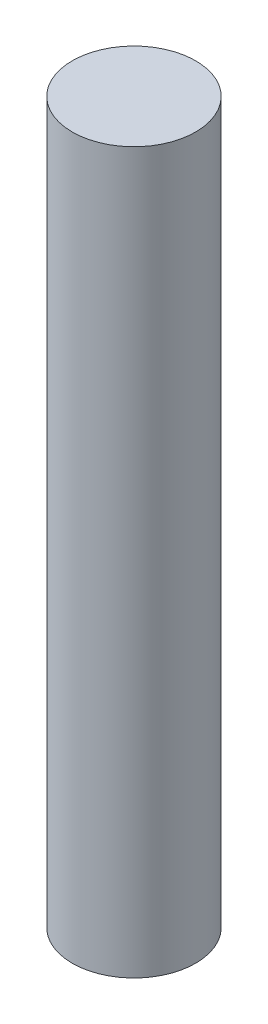
ISO-10303-21;
HEADER;
FILE_DESCRIPTION(('STEP AP214'),'2;1');
FILE_NAME('part.step','',(''),(''),'','','');
FILE_SCHEMA(('AUTOMOTIVE_DESIGN { 1 0 10303 214 1 1 1 1 }'));
ENDSEC;
DATA;
#1=APPLICATION_CONTEXT('core data for automotive mechanical design processes');
#2=APPLICATION_PROTOCOL_DEFINITION('international standard','automotive_design',2000,#1);
#3=PRODUCT_CONTEXT('',#1,'mechanical');
#4=PRODUCT('Part','Part','',(#3));
#5=PRODUCT_RELATED_PRODUCT_CATEGORY('part','',(#4));
#6=PRODUCT_DEFINITION_FORMATION('','',#4);
#7=PRODUCT_DEFINITION_CONTEXT('part definition',#1,'design');
#8=PRODUCT_DEFINITION('design','',#6,#7);
#9=PRODUCT_DEFINITION_SHAPE('','',#8);
#10=(LENGTH_UNIT() NAMED_UNIT(*) SI_UNIT(.MILLI.,.METRE.));
#11=(NAMED_UNIT(*) PLANE_ANGLE_UNIT() SI_UNIT($,.RADIAN.));
#12=(NAMED_UNIT(*) SI_UNIT($,.STERADIAN.) SOLID_ANGLE_UNIT());
#13=UNCERTAINTY_MEASURE_WITH_UNIT(LENGTH_MEASURE(1.E-05),#10,'distance_accuracy_value','');
#14=(GEOMETRIC_REPRESENTATION_CONTEXT(3) GLOBAL_UNCERTAINTY_ASSIGNED_CONTEXT((#13)) GLOBAL_UNIT_ASSIGNED_CONTEXT((#10,
#11,#12)) REPRESENTATION_CONTEXT('',''));
#15=CARTESIAN_POINT('',(0.,0.,0.));
#16=DIRECTION('',(0.,0.,1.));
#17=DIRECTION('',(1.,0.,0.));
#18=AXIS2_PLACEMENT_3D('',#15,#16,#17);
#19=CARTESIAN_POINT('',(0.,35.,0.));
#20=DIRECTION('',(0.,-1.,0.));
#21=DIRECTION('',(0.,0.,-1.));
#22=AXIS2_PLACEMENT_3D('',#19,#20,#21);
#23=CYLINDRICAL_SURFACE('',#22,3.);
#24=CARTESIAN_POINT('',(0.,35.,0.));
#25=DIRECTION('',(0.,1.,0.));
#26=DIRECTION('',(0.,0.,1.));
#27=AXIS2_PLACEMENT_3D('',#24,#25,#26);
#28=CIRCLE('',#27,3.);
#29=CARTESIAN_POINT('',(0.,35.,3.));
#30=VERTEX_POINT('',#29);
#31=EDGE_CURVE('E10',#30,#30,#28,.T.);
#32=ORIENTED_EDGE('',*,*,#31,.F.);
#33=EDGE_LOOP('',(#32));
#34=FACE_BOUND('',#33,.T.);
#35=CARTESIAN_POINT('',(0.,0.,0.));
#36=DIRECTION('',(0.,1.,0.));
#37=DIRECTION('',(0.,0.,1.));
#38=AXIS2_PLACEMENT_3D('',#35,#36,#37);
#39=CIRCLE('',#38,3.);
#40=CARTESIAN_POINT('',(0.,0.,3.));
#41=VERTEX_POINT('',#40);
#42=EDGE_CURVE('E32',#41,#41,#39,.T.);
#43=ORIENTED_EDGE('',*,*,#42,.T.);
#44=EDGE_LOOP('',(#43));
#45=FACE_BOUND('',#44,.T.);
#46=ADVANCED_FACE('F29',(#34,#45),#23,.T.);
#47=CARTESIAN_POINT('',(0.,35.,0.));
#48=DIRECTION('',(0.,1.,0.));
#49=DIRECTION('',(0.,0.,1.));
#50=AXIS2_PLACEMENT_3D('',#47,#48,#49);
#51=PLANE('',#50);
#52=ORIENTED_EDGE('',*,*,#31,.T.);
#53=EDGE_LOOP('',(#52));
#54=FACE_BOUND('',#53,.T.);
#55=ADVANCED_FACE('F44',(#54),#51,.T.);
#56=CARTESIAN_POINT('',(0.,0.,0.));
#57=DIRECTION('',(0.,1.,0.));
#58=DIRECTION('',(0.,0.,1.));
#59=AXIS2_PLACEMENT_3D('',#56,#57,#58);
#60=PLANE('',#59);
#61=ORIENTED_EDGE('',*,*,#42,.F.);
#62=EDGE_LOOP('',(#61));
#63=FACE_BOUND('',#62,.T.);
#64=ADVANCED_FACE('F42',(#63),#60,.F.);
#65=CLOSED_SHELL('',(#46,#55,#64));
#66=MANIFOLD_SOLID_BREP('B2',#65);
#67=ADVANCED_BREP_SHAPE_REPRESENTATION('',(#18,#66),#14);
#68=SHAPE_DEFINITION_REPRESENTATION(#9,#67);
ENDSEC;
END-ISO-10303-21;
